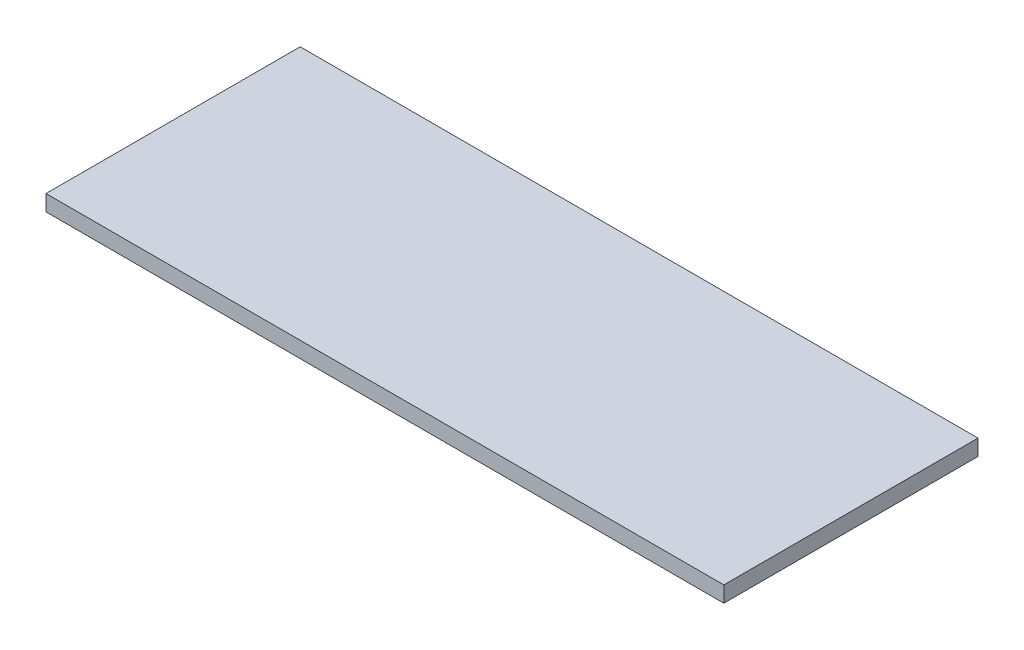
ISO-10303-21;
HEADER;
FILE_DESCRIPTION(('STEP AP214'),'2;1');
FILE_NAME('part.step','',(''),(''),'','','');
FILE_SCHEMA(('AUTOMOTIVE_DESIGN { 1 0 10303 214 1 1 1 1 }'));
ENDSEC;
DATA;
#1=APPLICATION_CONTEXT('core data for automotive mechanical design processes');
#2=APPLICATION_PROTOCOL_DEFINITION('international standard','automotive_design',2000,#1);
#3=PRODUCT_CONTEXT('',#1,'mechanical');
#4=PRODUCT('Part','Part','',(#3));
#5=PRODUCT_RELATED_PRODUCT_CATEGORY('part','',(#4));
#6=PRODUCT_DEFINITION_FORMATION('','',#4);
#7=PRODUCT_DEFINITION_CONTEXT('part definition',#1,'design');
#8=PRODUCT_DEFINITION('design','',#6,#7);
#9=PRODUCT_DEFINITION_SHAPE('','',#8);
#10=(LENGTH_UNIT() NAMED_UNIT(*) SI_UNIT(.MILLI.,.METRE.));
#11=(NAMED_UNIT(*) PLANE_ANGLE_UNIT() SI_UNIT($,.RADIAN.));
#12=(NAMED_UNIT(*) SI_UNIT($,.STERADIAN.) SOLID_ANGLE_UNIT());
#13=UNCERTAINTY_MEASURE_WITH_UNIT(LENGTH_MEASURE(1.E-05),#10,'distance_accuracy_value','');
#14=(GEOMETRIC_REPRESENTATION_CONTEXT(3) GLOBAL_UNCERTAINTY_ASSIGNED_CONTEXT((#13)) GLOBAL_UNIT_ASSIGNED_CONTEXT((#10,
#11,#12)) REPRESENTATION_CONTEXT('',''));
#15=CARTESIAN_POINT('',(0.,0.,0.));
#16=DIRECTION('',(0.,0.,1.));
#17=DIRECTION('',(1.,0.,0.));
#18=AXIS2_PLACEMENT_3D('',#15,#16,#17);
#19=CARTESIAN_POINT('',(0.,4.7625,0.));
#20=DIRECTION('',(1.,0.,0.));
#21=DIRECTION('',(0.,0.,-1.));
#22=AXIS2_PLACEMENT_3D('',#19,#20,#21);
#23=PLANE('',#22);
#24=DIRECTION('',(0.,0.,1.));
#25=VECTOR('',#24,1.);
#26=CARTESIAN_POINT('',(0.,0.,0.));
#27=LINE('',#26,#25);
#28=CARTESIAN_POINT('',(0.,0.,0.));
#29=VERTEX_POINT('',#28);
#30=CARTESIAN_POINT('',(0.,0.,76.2));
#31=VERTEX_POINT('',#30);
#32=EDGE_CURVE('E96',#29,#31,#27,.T.);
#33=ORIENTED_EDGE('',*,*,#32,.T.);
#34=DIRECTION('',(0.,-1.,0.));
#35=VECTOR('',#34,1.);
#36=CARTESIAN_POINT('',(0.,4.7625,76.2));
#37=LINE('',#36,#35);
#38=CARTESIAN_POINT('',(0.,4.7625,76.2));
#39=VERTEX_POINT('',#38);
#40=EDGE_CURVE('E11',#39,#31,#37,.T.);
#41=ORIENTED_EDGE('',*,*,#40,.F.);
#42=DIRECTION('',(0.,0.,1.));
#43=VECTOR('',#42,1.);
#44=CARTESIAN_POINT('',(0.,4.7625,0.));
#45=LINE('',#44,#43);
#46=CARTESIAN_POINT('',(0.,4.7625,0.));
#47=VERTEX_POINT('',#46);
#48=EDGE_CURVE('E82',#47,#39,#45,.T.);
#49=ORIENTED_EDGE('',*,*,#48,.F.);
#50=DIRECTION('',(0.,-1.,0.));
#51=VECTOR('',#50,1.);
#52=CARTESIAN_POINT('',(0.,4.7625,0.));
#53=LINE('',#52,#51);
#54=EDGE_CURVE('E49',#47,#29,#53,.T.);
#55=ORIENTED_EDGE('',*,*,#54,.T.);
#56=EDGE_LOOP('',(#33,#41,#49,#55));
#57=FACE_BOUND('',#56,.T.);
#58=ADVANCED_FACE('F33',(#57),#23,.F.);
#59=CARTESIAN_POINT('',(0.,4.7625,76.2));
#60=DIRECTION('',(0.,0.,-1.));
#61=DIRECTION('',(-1.,0.,0.));
#62=AXIS2_PLACEMENT_3D('',#59,#60,#61);
#63=PLANE('',#62);
#64=DIRECTION('',(1.,0.,0.));
#65=VECTOR('',#64,1.);
#66=CARTESIAN_POINT('',(0.,0.,76.2));
#67=LINE('',#66,#65);
#68=CARTESIAN_POINT('',(203.2,0.,76.2));
#69=VERTEX_POINT('',#68);
#70=EDGE_CURVE('E87',#31,#69,#67,.T.);
#71=ORIENTED_EDGE('',*,*,#70,.T.);
#72=DIRECTION('',(0.,-1.,0.));
#73=VECTOR('',#72,1.);
#74=CARTESIAN_POINT('',(203.2,4.7625,76.2));
#75=LINE('',#74,#73);
#76=CARTESIAN_POINT('',(203.2,4.7625,76.2));
#77=VERTEX_POINT('',#76);
#78=EDGE_CURVE('E41',#77,#69,#75,.T.);
#79=ORIENTED_EDGE('',*,*,#78,.F.);
#80=DIRECTION('',(1.,0.,0.));
#81=VECTOR('',#80,1.);
#82=CARTESIAN_POINT('',(0.,4.7625,76.2));
#83=LINE('',#82,#81);
#84=EDGE_CURVE('E74',#39,#77,#83,.T.);
#85=ORIENTED_EDGE('',*,*,#84,.F.);
#86=ORIENTED_EDGE('',*,*,#40,.T.);
#87=EDGE_LOOP('',(#71,#79,#85,#86));
#88=FACE_BOUND('',#87,.T.);
#89=ADVANCED_FACE('F86',(#88),#63,.F.);
#90=CARTESIAN_POINT('',(203.2,4.7625,0.));
#91=DIRECTION('',(1.,0.,0.));
#92=DIRECTION('',(0.,0.,-1.));
#93=AXIS2_PLACEMENT_3D('',#90,#91,#92);
#94=PLANE('',#93);
#95=DIRECTION('',(0.,0.,1.));
#96=VECTOR('',#95,1.);
#97=CARTESIAN_POINT('',(203.2,0.,0.));
#98=LINE('',#97,#96);
#99=CARTESIAN_POINT('',(203.2,0.,0.));
#100=VERTEX_POINT('',#99);
#101=EDGE_CURVE('E99',#100,#69,#98,.T.);
#102=ORIENTED_EDGE('',*,*,#101,.F.);
#103=DIRECTION('',(0.,-1.,0.));
#104=VECTOR('',#103,1.);
#105=CARTESIAN_POINT('',(203.2,4.7625,0.));
#106=LINE('',#105,#104);
#107=CARTESIAN_POINT('',(203.2,4.7625,0.));
#108=VERTEX_POINT('',#107);
#109=EDGE_CURVE('E63',#108,#100,#106,.T.);
#110=ORIENTED_EDGE('',*,*,#109,.F.);
#111=DIRECTION('',(0.,0.,1.));
#112=VECTOR('',#111,1.);
#113=CARTESIAN_POINT('',(203.2,4.7625,0.));
#114=LINE('',#113,#112);
#115=EDGE_CURVE('E81',#108,#77,#114,.T.);
#116=ORIENTED_EDGE('',*,*,#115,.T.);
#117=ORIENTED_EDGE('',*,*,#78,.T.);
#118=EDGE_LOOP('',(#102,#110,#116,#117));
#119=FACE_BOUND('',#118,.T.);
#120=ADVANCED_FACE('F90',(#119),#94,.T.);
#121=CARTESIAN_POINT('',(0.,4.7625,0.));
#122=DIRECTION('',(0.,0.,-1.));
#123=DIRECTION('',(-1.,0.,0.));
#124=AXIS2_PLACEMENT_3D('',#121,#122,#123);
#125=PLANE('',#124);
#126=DIRECTION('',(1.,0.,0.));
#127=VECTOR('',#126,1.);
#128=CARTESIAN_POINT('',(0.,0.,0.));
#129=LINE('',#128,#127);
#130=EDGE_CURVE('E101',#29,#100,#129,.T.);
#131=ORIENTED_EDGE('',*,*,#130,.F.);
#132=ORIENTED_EDGE('',*,*,#54,.F.);
#133=DIRECTION('',(1.,0.,0.));
#134=VECTOR('',#133,1.);
#135=CARTESIAN_POINT('',(0.,4.7625,0.));
#136=LINE('',#135,#134);
#137=EDGE_CURVE('E91',#47,#108,#136,.T.);
#138=ORIENTED_EDGE('',*,*,#137,.T.);
#139=ORIENTED_EDGE('',*,*,#109,.T.);
#140=EDGE_LOOP('',(#131,#132,#138,#139));
#141=FACE_BOUND('',#140,.T.);
#142=ADVANCED_FACE('F107',(#141),#125,.T.);
#143=CARTESIAN_POINT('',(0.,4.7625,0.));
#144=DIRECTION('',(0.,1.,0.));
#145=DIRECTION('',(0.,0.,1.));
#146=AXIS2_PLACEMENT_3D('',#143,#144,#145);
#147=PLANE('',#146);
#148=ORIENTED_EDGE('',*,*,#48,.T.);
#149=ORIENTED_EDGE('',*,*,#84,.T.);
#150=ORIENTED_EDGE('',*,*,#115,.F.);
#151=ORIENTED_EDGE('',*,*,#137,.F.);
#152=EDGE_LOOP('',(#148,#149,#150,#151));
#153=FACE_BOUND('',#152,.T.);
#154=ADVANCED_FACE('F78',(#153),#147,.T.);
#155=CARTESIAN_POINT('',(0.,0.,0.));
#156=DIRECTION('',(0.,1.,0.));
#157=DIRECTION('',(0.,0.,1.));
#158=AXIS2_PLACEMENT_3D('',#155,#156,#157);
#159=PLANE('',#158);
#160=ORIENTED_EDGE('',*,*,#32,.F.);
#161=ORIENTED_EDGE('',*,*,#130,.T.);
#162=ORIENTED_EDGE('',*,*,#101,.T.);
#163=ORIENTED_EDGE('',*,*,#70,.F.);
#164=EDGE_LOOP('',(#160,#161,#162,#163));
#165=FACE_BOUND('',#164,.T.);
#166=ADVANCED_FACE('F106',(#165),#159,.F.);
#167=CLOSED_SHELL('',(#58,#89,#120,#142,#154,#166));
#168=MANIFOLD_SOLID_BREP('B2',#167);
#169=ADVANCED_BREP_SHAPE_REPRESENTATION('',(#18,#168),#14);
#170=SHAPE_DEFINITION_REPRESENTATION(#9,#169);
ENDSEC;
END-ISO-10303-21;
